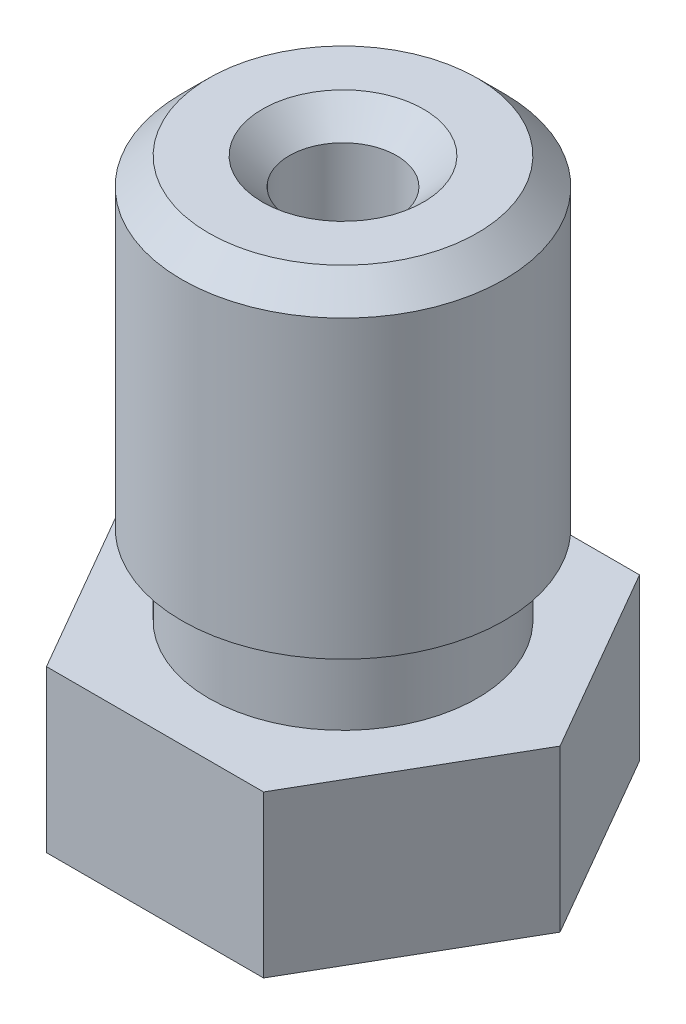
ISO-10303-21;
HEADER;
FILE_DESCRIPTION(('STEP AP214'),'2;1');
FILE_NAME('part.step','',(''),(''),'','','');
FILE_SCHEMA(('AUTOMOTIVE_DESIGN { 1 0 10303 214 1 1 1 1 }'));
ENDSEC;
DATA;
#1=APPLICATION_CONTEXT('core data for automotive mechanical design processes');
#2=APPLICATION_PROTOCOL_DEFINITION('international standard','automotive_design',2000,#1);
#3=PRODUCT_CONTEXT('',#1,'mechanical');
#4=PRODUCT('Part','Part','',(#3));
#5=PRODUCT_RELATED_PRODUCT_CATEGORY('part','',(#4));
#6=PRODUCT_DEFINITION_FORMATION('','',#4);
#7=PRODUCT_DEFINITION_CONTEXT('part definition',#1,'design');
#8=PRODUCT_DEFINITION('design','',#6,#7);
#9=PRODUCT_DEFINITION_SHAPE('','',#8);
#10=(LENGTH_UNIT() NAMED_UNIT(*) SI_UNIT(.MILLI.,.METRE.));
#11=(NAMED_UNIT(*) PLANE_ANGLE_UNIT() SI_UNIT($,.RADIAN.));
#12=(NAMED_UNIT(*) SI_UNIT($,.STERADIAN.) SOLID_ANGLE_UNIT());
#13=UNCERTAINTY_MEASURE_WITH_UNIT(LENGTH_MEASURE(1.E-05),#10,'distance_accuracy_value','');
#14=(GEOMETRIC_REPRESENTATION_CONTEXT(3) GLOBAL_UNCERTAINTY_ASSIGNED_CONTEXT((#13)) GLOBAL_UNIT_ASSIGNED_CONTEXT((#10,
#11,#12)) REPRESENTATION_CONTEXT('',''));
#15=CARTESIAN_POINT('',(0.,0.,0.));
#16=DIRECTION('',(0.,0.,1.));
#17=DIRECTION('',(1.,0.,0.));
#18=AXIS2_PLACEMENT_3D('',#15,#16,#17);
#19=CARTESIAN_POINT('',(2.02072594216369,3.,3.5));
#20=DIRECTION('',(0.,0.,1.));
#21=DIRECTION('',(1.,0.,0.));
#22=AXIS2_PLACEMENT_3D('',#19,#20,#21);
#23=PLANE('',#22);
#24=DIRECTION('',(-1.,0.,0.));
#25=VECTOR('',#24,1.);
#26=CARTESIAN_POINT('',(2.02072594216369,0.,3.5));
#27=LINE('',#26,#25);
#28=CARTESIAN_POINT('',(2.02072594216369,0.,3.5));
#29=VERTEX_POINT('',#28);
#30=CARTESIAN_POINT('',(-2.02072594216369,0.,3.5));
#31=VERTEX_POINT('',#30);
#32=EDGE_CURVE('E121',#29,#31,#27,.T.);
#33=ORIENTED_EDGE('',*,*,#32,.F.);
#34=DIRECTION('',(0.,-1.,0.));
#35=VECTOR('',#34,1.);
#36=CARTESIAN_POINT('',(2.02072594216369,3.,3.5));
#37=LINE('',#36,#35);
#38=CARTESIAN_POINT('',(2.02072594216369,3.,3.5));
#39=VERTEX_POINT('',#38);
#40=EDGE_CURVE('E50',#39,#29,#37,.T.);
#41=ORIENTED_EDGE('',*,*,#40,.F.);
#42=DIRECTION('',(-1.,0.,0.));
#43=VECTOR('',#42,1.);
#44=CARTESIAN_POINT('',(2.02072594216369,3.,3.5));
#45=LINE('',#44,#43);
#46=CARTESIAN_POINT('',(-2.02072594216369,3.,3.5));
#47=VERTEX_POINT('',#46);
#48=EDGE_CURVE('E137',#39,#47,#45,.T.);
#49=ORIENTED_EDGE('',*,*,#48,.T.);
#50=DIRECTION('',(0.,-1.,0.));
#51=VECTOR('',#50,1.);
#52=CARTESIAN_POINT('',(-2.02072594216369,3.,3.5));
#53=LINE('',#52,#51);
#54=EDGE_CURVE('E85',#47,#31,#53,.T.);
#55=ORIENTED_EDGE('',*,*,#54,.T.);
#56=EDGE_LOOP('',(#33,#41,#49,#55));
#57=FACE_BOUND('',#56,.T.);
#58=ADVANCED_FACE('F33',(#57),#23,.T.);
#59=CARTESIAN_POINT('',(4.04145188432738,3.,0.));
#60=DIRECTION('',(0.866025403784439,0.,0.5));
#61=DIRECTION('',(0.5,0.,-0.866025403784439));
#62=AXIS2_PLACEMENT_3D('',#59,#60,#61);
#63=PLANE('',#62);
#64=DIRECTION('',(-0.5,0.,0.866025403784439));
#65=VECTOR('',#64,1.);
#66=CARTESIAN_POINT('',(4.04145188432738,0.,0.));
#67=LINE('',#66,#65);
#68=CARTESIAN_POINT('',(4.04145188432738,0.,0.));
#69=VERTEX_POINT('',#68);
#70=EDGE_CURVE('E134',#69,#29,#67,.T.);
#71=ORIENTED_EDGE('',*,*,#70,.F.);
#72=DIRECTION('',(0.,-1.,0.));
#73=VECTOR('',#72,1.);
#74=CARTESIAN_POINT('',(4.04145188432738,3.,0.));
#75=LINE('',#74,#73);
#76=CARTESIAN_POINT('',(4.04145188432738,3.,0.));
#77=VERTEX_POINT('',#76);
#78=EDGE_CURVE('E73',#77,#69,#75,.T.);
#79=ORIENTED_EDGE('',*,*,#78,.F.);
#80=DIRECTION('',(-0.5,0.,0.866025403784439));
#81=VECTOR('',#80,1.);
#82=CARTESIAN_POINT('',(4.04145188432738,3.,0.));
#83=LINE('',#82,#81);
#84=EDGE_CURVE('E111',#77,#39,#83,.T.);
#85=ORIENTED_EDGE('',*,*,#84,.T.);
#86=ORIENTED_EDGE('',*,*,#40,.T.);
#87=EDGE_LOOP('',(#71,#79,#85,#86));
#88=FACE_BOUND('',#87,.T.);
#89=ADVANCED_FACE('F210',(#88),#63,.T.);
#90=CARTESIAN_POINT('',(2.02072594216369,3.,-3.5));
#91=DIRECTION('',(0.866025403784438,0.,-0.500000000000001));
#92=DIRECTION('',(-0.500000000000001,0.,-0.866025403784438));
#93=AXIS2_PLACEMENT_3D('',#90,#91,#92);
#94=PLANE('',#93);
#95=DIRECTION('',(0.500000000000001,0.,0.866025403784438));
#96=VECTOR('',#95,1.);
#97=CARTESIAN_POINT('',(2.02072594216369,0.,-3.5));
#98=LINE('',#97,#96);
#99=CARTESIAN_POINT('',(2.02072594216369,0.,-3.5));
#100=VERTEX_POINT('',#99);
#101=EDGE_CURVE('E98',#100,#69,#98,.T.);
#102=ORIENTED_EDGE('',*,*,#101,.F.);
#103=DIRECTION('',(0.,-1.,0.));
#104=VECTOR('',#103,1.);
#105=CARTESIAN_POINT('',(2.02072594216369,3.,-3.5));
#106=LINE('',#105,#104);
#107=CARTESIAN_POINT('',(2.02072594216369,3.,-3.5));
#108=VERTEX_POINT('',#107);
#109=EDGE_CURVE('E93',#108,#100,#106,.T.);
#110=ORIENTED_EDGE('',*,*,#109,.F.);
#111=DIRECTION('',(0.500000000000001,0.,0.866025403784438));
#112=VECTOR('',#111,1.);
#113=CARTESIAN_POINT('',(2.02072594216369,3.,-3.5));
#114=LINE('',#113,#112);
#115=EDGE_CURVE('E96',#108,#77,#114,.T.);
#116=ORIENTED_EDGE('',*,*,#115,.T.);
#117=ORIENTED_EDGE('',*,*,#78,.T.);
#118=EDGE_LOOP('',(#102,#110,#116,#117));
#119=FACE_BOUND('',#118,.T.);
#120=ADVANCED_FACE('F95',(#119),#94,.T.);
#121=CARTESIAN_POINT('',(-2.02072594216369,3.,-3.5));
#122=DIRECTION('',(0.,0.,-1.));
#123=DIRECTION('',(-1.,0.,0.));
#124=AXIS2_PLACEMENT_3D('',#121,#122,#123);
#125=PLANE('',#124);
#126=DIRECTION('',(1.,0.,0.));
#127=VECTOR('',#126,1.);
#128=CARTESIAN_POINT('',(-2.02072594216369,0.,-3.5));
#129=LINE('',#128,#127);
#130=CARTESIAN_POINT('',(-2.02072594216369,0.,-3.5));
#131=VERTEX_POINT('',#130);
#132=EDGE_CURVE('E131',#131,#100,#129,.T.);
#133=ORIENTED_EDGE('',*,*,#132,.F.);
#134=DIRECTION('',(0.,-1.,0.));
#135=VECTOR('',#134,1.);
#136=CARTESIAN_POINT('',(-2.02072594216369,3.,-3.5));
#137=LINE('',#136,#135);
#138=CARTESIAN_POINT('',(-2.02072594216369,3.,-3.5));
#139=VERTEX_POINT('',#138);
#140=EDGE_CURVE('E103',#139,#131,#137,.T.);
#141=ORIENTED_EDGE('',*,*,#140,.F.);
#142=DIRECTION('',(1.,0.,0.));
#143=VECTOR('',#142,1.);
#144=CARTESIAN_POINT('',(-2.02072594216369,3.,-3.5));
#145=LINE('',#144,#143);
#146=EDGE_CURVE('E109',#139,#108,#145,.T.);
#147=ORIENTED_EDGE('',*,*,#146,.T.);
#148=ORIENTED_EDGE('',*,*,#109,.T.);
#149=EDGE_LOOP('',(#133,#141,#147,#148));
#150=FACE_BOUND('',#149,.T.);
#151=ADVANCED_FACE('F113',(#150),#125,.T.);
#152=CARTESIAN_POINT('',(-4.04145188432738,3.,0.));
#153=DIRECTION('',(-0.866025403784439,0.,-0.5));
#154=DIRECTION('',(-0.5,0.,0.866025403784439));
#155=AXIS2_PLACEMENT_3D('',#152,#153,#154);
#156=PLANE('',#155);
#157=DIRECTION('',(0.5,0.,-0.866025403784439));
#158=VECTOR('',#157,1.);
#159=CARTESIAN_POINT('',(-4.04145188432738,0.,0.));
#160=LINE('',#159,#158);
#161=CARTESIAN_POINT('',(-4.04145188432738,0.,0.));
#162=VERTEX_POINT('',#161);
#163=EDGE_CURVE('E128',#162,#131,#160,.T.);
#164=ORIENTED_EDGE('',*,*,#163,.F.);
#165=DIRECTION('',(0.,-1.,0.));
#166=VECTOR('',#165,1.);
#167=CARTESIAN_POINT('',(-4.04145188432738,3.,0.));
#168=LINE('',#167,#166);
#169=CARTESIAN_POINT('',(-4.04145188432738,3.,0.));
#170=VERTEX_POINT('',#169);
#171=EDGE_CURVE('E142',#170,#162,#168,.T.);
#172=ORIENTED_EDGE('',*,*,#171,.F.);
#173=DIRECTION('',(0.5,0.,-0.866025403784439));
#174=VECTOR('',#173,1.);
#175=CARTESIAN_POINT('',(-4.04145188432738,3.,0.));
#176=LINE('',#175,#174);
#177=EDGE_CURVE('E114',#170,#139,#176,.T.);
#178=ORIENTED_EDGE('',*,*,#177,.T.);
#179=ORIENTED_EDGE('',*,*,#140,.T.);
#180=EDGE_LOOP('',(#164,#172,#178,#179));
#181=FACE_BOUND('',#180,.T.);
#182=ADVANCED_FACE('F224',(#181),#156,.T.);
#183=CARTESIAN_POINT('',(-2.02072594216369,3.,3.5));
#184=DIRECTION('',(-0.866025403784439,0.,0.5));
#185=DIRECTION('',(0.5,0.,0.866025403784439));
#186=AXIS2_PLACEMENT_3D('',#183,#184,#185);
#187=PLANE('',#186);
#188=DIRECTION('',(-0.5,0.,-0.866025403784439));
#189=VECTOR('',#188,1.);
#190=CARTESIAN_POINT('',(-2.02072594216369,0.,3.5));
#191=LINE('',#190,#189);
#192=EDGE_CURVE('E124',#31,#162,#191,.T.);
#193=ORIENTED_EDGE('',*,*,#192,.F.);
#194=ORIENTED_EDGE('',*,*,#54,.F.);
#195=DIRECTION('',(-0.5,0.,-0.866025403784439));
#196=VECTOR('',#195,1.);
#197=CARTESIAN_POINT('',(-2.02072594216369,3.,3.5));
#198=LINE('',#197,#196);
#199=EDGE_CURVE('E116',#47,#170,#198,.T.);
#200=ORIENTED_EDGE('',*,*,#199,.T.);
#201=ORIENTED_EDGE('',*,*,#171,.T.);
#202=EDGE_LOOP('',(#193,#194,#200,#201));
#203=FACE_BOUND('',#202,.T.);
#204=ADVANCED_FACE('F206',(#203),#187,.T.);
#205=CARTESIAN_POINT('',(0.,3.,0.));
#206=DIRECTION('',(0.,-1.,0.));
#207=DIRECTION('',(0.,0.,-1.));
#208=AXIS2_PLACEMENT_3D('',#205,#206,#207);
#209=PLANE('',#208);
#210=CARTESIAN_POINT('',(0.,3.,0.));
#211=DIRECTION('',(0.,1.,0.));
#212=DIRECTION('',(0.,0.,1.));
#213=AXIS2_PLACEMENT_3D('',#210,#211,#212);
#214=CIRCLE('',#213,2.5);
#215=CARTESIAN_POINT('',(0.,3.,2.5));
#216=VERTEX_POINT('',#215);
#217=EDGE_CURVE('E125',#216,#216,#214,.T.);
#218=ORIENTED_EDGE('',*,*,#217,.F.);
#219=EDGE_LOOP('',(#218));
#220=FACE_BOUND('',#219,.T.);
#221=ORIENTED_EDGE('',*,*,#48,.F.);
#222=ORIENTED_EDGE('',*,*,#84,.F.);
#223=ORIENTED_EDGE('',*,*,#115,.F.);
#224=ORIENTED_EDGE('',*,*,#146,.F.);
#225=ORIENTED_EDGE('',*,*,#177,.F.);
#226=ORIENTED_EDGE('',*,*,#199,.F.);
#227=EDGE_LOOP('',(#221,#222,#223,#224,#225,#226));
#228=FACE_BOUND('',#227,.T.);
#229=ADVANCED_FACE('F107',(#220,#228),#209,.F.);
#230=CARTESIAN_POINT('',(0.,0.,0.));
#231=DIRECTION('',(0.,-1.,0.));
#232=DIRECTION('',(0.,0.,-1.));
#233=AXIS2_PLACEMENT_3D('',#230,#231,#232);
#234=PLANE('',#233);
#235=CARTESIAN_POINT('',(0.,0.,0.));
#236=DIRECTION('',(0.,-1.,0.));
#237=DIRECTION('',(0.,0.,-1.));
#238=AXIS2_PLACEMENT_3D('',#235,#236,#237);
#239=CIRCLE('',#238,2.50000000004502);
#240=CARTESIAN_POINT('',(0.,0.,-2.50000000004502));
#241=VERTEX_POINT('',#240);
#242=EDGE_CURVE('E139',#241,#241,#239,.T.);
#243=ORIENTED_EDGE('',*,*,#242,.F.);
#244=EDGE_LOOP('',(#243));
#245=FACE_BOUND('',#244,.T.);
#246=ORIENTED_EDGE('',*,*,#32,.T.);
#247=ORIENTED_EDGE('',*,*,#192,.T.);
#248=ORIENTED_EDGE('',*,*,#163,.T.);
#249=ORIENTED_EDGE('',*,*,#132,.T.);
#250=ORIENTED_EDGE('',*,*,#101,.T.);
#251=ORIENTED_EDGE('',*,*,#70,.T.);
#252=EDGE_LOOP('',(#246,#247,#248,#249,#250,#251));
#253=FACE_BOUND('',#252,.T.);
#254=ADVANCED_FACE('F209',(#245,#253),#234,.T.);
#255=CARTESIAN_POINT('',(0.,3.,0.));
#256=DIRECTION('',(0.,1.,0.));
#257=DIRECTION('',(0.,0.,1.));
#258=AXIS2_PLACEMENT_3D('',#255,#256,#257);
#259=CYLINDRICAL_SURFACE('',#258,2.5);
#260=ORIENTED_EDGE('',*,*,#217,.T.);
#261=EDGE_LOOP('',(#260));
#262=FACE_BOUND('',#261,.T.);
#263=CARTESIAN_POINT('',(0.,4.5,0.));
#264=DIRECTION('',(0.,1.,0.));
#265=DIRECTION('',(0.,0.,1.));
#266=AXIS2_PLACEMENT_3D('',#263,#264,#265);
#267=CIRCLE('',#266,2.5);
#268=CARTESIAN_POINT('',(0.,4.5,2.5));
#269=VERTEX_POINT('',#268);
#270=EDGE_CURVE('E198',#269,#269,#267,.T.);
#271=ORIENTED_EDGE('',*,*,#270,.F.);
#272=EDGE_LOOP('',(#271));
#273=FACE_BOUND('',#272,.T.);
#274=ADVANCED_FACE('F167',(#262,#273),#259,.T.);
#275=CARTESIAN_POINT('',(0.,10.5,0.));
#276=DIRECTION('',(0.,1.,0.));
#277=DIRECTION('',(0.,0.,1.));
#278=AXIS2_PLACEMENT_3D('',#275,#276,#277);
#279=PLANE('',#278);
#280=CARTESIAN_POINT('',(0.,10.5,0.));
#281=DIRECTION('',(0.,1.,0.));
#282=DIRECTION('',(0.,0.,1.));
#283=AXIS2_PLACEMENT_3D('',#280,#281,#282);
#284=CIRCLE('',#283,2.4999999999834);
#285=CARTESIAN_POINT('',(0.,10.5,2.4999999999834));
#286=VERTEX_POINT('',#285);
#287=EDGE_CURVE('E150',#286,#286,#284,.T.);
#288=ORIENTED_EDGE('',*,*,#287,.T.);
#289=EDGE_LOOP('',(#288));
#290=FACE_BOUND('',#289,.T.);
#291=CARTESIAN_POINT('',(-1.10963134903613E-11,10.5,0.));
#292=DIRECTION('',(0.,1.,0.));
#293=DIRECTION('',(0.,0.,1.));
#294=AXIS2_PLACEMENT_3D('',#291,#292,#293);
#295=CIRCLE('',#294,1.5000000000277);
#296=CARTESIAN_POINT('',(-1.10963134903613E-11,10.5,1.5000000000277));
#297=VERTEX_POINT('',#296);
#298=EDGE_CURVE('E147',#297,#297,#295,.F.);
#299=ORIENTED_EDGE('',*,*,#298,.T.);
#300=EDGE_LOOP('',(#299));
#301=FACE_BOUND('',#300,.T.);
#302=ADVANCED_FACE('F164',(#290,#301),#279,.T.);
#303=CARTESIAN_POINT('',(0.,3.,0.));
#304=DIRECTION('',(0.,1.,0.));
#305=DIRECTION('',(0.,0.,1.));
#306=AXIS2_PLACEMENT_3D('',#303,#304,#305);
#307=CYLINDRICAL_SURFACE('',#306,3.);
#308=CARTESIAN_POINT('',(0.,9.9999999999834,0.));
#309=DIRECTION('',(0.,1.,0.));
#310=DIRECTION('',(0.,0.,1.));
#311=AXIS2_PLACEMENT_3D('',#308,#309,#310);
#312=CIRCLE('',#311,3.);
#313=CARTESIAN_POINT('',(0.,9.9999999999834,3.));
#314=VERTEX_POINT('',#313);
#315=EDGE_CURVE('E42',#314,#314,#312,.F.);
#316=ORIENTED_EDGE('',*,*,#315,.T.);
#317=EDGE_LOOP('',(#316));
#318=FACE_BOUND('',#317,.T.);
#319=CARTESIAN_POINT('',(0.,4.5,0.));
#320=DIRECTION('',(0.,1.,0.));
#321=DIRECTION('',(0.,0.,1.));
#322=AXIS2_PLACEMENT_3D('',#319,#320,#321);
#323=CIRCLE('',#322,3.);
#324=CARTESIAN_POINT('',(0.,4.5,3.));
#325=VERTEX_POINT('',#324);
#326=EDGE_CURVE('E201',#325,#325,#323,.T.);
#327=ORIENTED_EDGE('',*,*,#326,.T.);
#328=EDGE_LOOP('',(#327));
#329=FACE_BOUND('',#328,.T.);
#330=ADVANCED_FACE('F155',(#318,#329),#307,.T.);
#331=CARTESIAN_POINT('',(3.,4.5,0.));
#332=DIRECTION('',(0.,-1.,0.));
#333=DIRECTION('',(0.,0.,-1.));
#334=AXIS2_PLACEMENT_3D('',#331,#332,#333);
#335=PLANE('',#334);
#336=ORIENTED_EDGE('',*,*,#270,.T.);
#337=EDGE_LOOP('',(#336));
#338=FACE_BOUND('',#337,.T.);
#339=ORIENTED_EDGE('',*,*,#326,.F.);
#340=EDGE_LOOP('',(#339));
#341=FACE_BOUND('',#340,.T.);
#342=ADVANCED_FACE('F244',(#338,#341),#335,.T.);
#343=CARTESIAN_POINT('',(0.,-2.,0.));
#344=DIRECTION('',(0.,1.,0.));
#345=DIRECTION('',(-1.,0.,0.));
#346=AXIS2_PLACEMENT_3D('',#343,#344,#345);
#347=CONICAL_SURFACE('',#346,0.50000000004502,0.785398163397449);
#348=ORIENTED_EDGE('',*,*,#242,.T.);
#349=EDGE_LOOP('',(#348));
#350=FACE_BOUND('',#349,.T.);
#351=CARTESIAN_POINT('',(0.,-2.,0.));
#352=DIRECTION('',(0.,-1.,0.));
#353=DIRECTION('',(1.,0.,0.));
#354=AXIS2_PLACEMENT_3D('',#351,#352,#353);
#355=CIRCLE('',#354,0.50000000004502);
#356=CARTESIAN_POINT('',(0.50000000004502,-2.,0.));
#357=VERTEX_POINT('',#356);
#358=EDGE_CURVE('E189',#357,#357,#355,.T.);
#359=ORIENTED_EDGE('',*,*,#358,.F.);
#360=EDGE_LOOP('',(#359));
#361=FACE_BOUND('',#360,.T.);
#362=ADVANCED_FACE('F247',(#350,#361),#347,.T.);
#363=CARTESIAN_POINT('',(0.,-2.,0.));
#364=DIRECTION('',(0.,-1.,0.));
#365=DIRECTION('',(1.,0.,0.));
#366=AXIS2_PLACEMENT_3D('',#363,#364,#365);
#367=PLANE('',#366);
#368=CARTESIAN_POINT('',(-1.10963134903613E-11,-2.,0.));
#369=DIRECTION('',(0.,1.,0.));
#370=DIRECTION('',(0.,0.,1.));
#371=AXIS2_PLACEMENT_3D('',#368,#369,#370);
#372=CIRCLE('',#371,0.25);
#373=CARTESIAN_POINT('',(-1.10963134903613E-11,-2.,0.25));
#374=VERTEX_POINT('',#373);
#375=EDGE_CURVE('E185',#374,#374,#372,.T.);
#376=ORIENTED_EDGE('',*,*,#375,.T.);
#377=EDGE_LOOP('',(#376));
#378=FACE_BOUND('',#377,.T.);
#379=ORIENTED_EDGE('',*,*,#358,.T.);
#380=EDGE_LOOP('',(#379));
#381=FACE_BOUND('',#380,.T.);
#382=ADVANCED_FACE('F251',(#378,#381),#367,.T.);
#383=CARTESIAN_POINT('',(-1.10963134903613E-11,-2.,0.));
#384=DIRECTION('',(0.,1.,0.));
#385=DIRECTION('',(0.,0.,1.));
#386=AXIS2_PLACEMENT_3D('',#383,#384,#385);
#387=CYLINDRICAL_SURFACE('',#386,0.25);
#388=ORIENTED_EDGE('',*,*,#375,.F.);
#389=EDGE_LOOP('',(#388));
#390=FACE_BOUND('',#389,.T.);
#391=CARTESIAN_POINT('',(-1.10963134903613E-11,-1.20000000003984,0.));
#392=DIRECTION('',(0.,1.,0.));
#393=DIRECTION('',(0.,0.,1.));
#394=AXIS2_PLACEMENT_3D('',#391,#392,#393);
#395=CIRCLE('',#394,0.25);
#396=CARTESIAN_POINT('',(-1.10963134903613E-11,-1.20000000003984,0.25));
#397=VERTEX_POINT('',#396);
#398=EDGE_CURVE('E273',#397,#397,#395,.T.);
#399=ORIENTED_EDGE('',*,*,#398,.T.);
#400=EDGE_LOOP('',(#399));
#401=FACE_BOUND('',#400,.T.);
#402=ADVANCED_FACE('F179',(#390,#401),#387,.F.);
#403=CARTESIAN_POINT('',(-1.10963134903613E-11,-2.,0.));
#404=DIRECTION('',(0.,1.,0.));
#405=DIRECTION('',(0.,0.,1.));
#406=AXIS2_PLACEMENT_3D('',#403,#404,#405);
#407=CYLINDRICAL_SURFACE('',#406,1.0000000000111);
#408=CARTESIAN_POINT('',(-1.10963134903613E-11,9.9999999999834,0.));
#409=DIRECTION('',(0.,1.,0.));
#410=DIRECTION('',(0.,0.,1.));
#411=AXIS2_PLACEMENT_3D('',#408,#409,#410);
#412=CIRCLE('',#411,1.0000000000111);
#413=CARTESIAN_POINT('',(-1.10963134903613E-11,9.9999999999834,1.0000000000111));
#414=VERTEX_POINT('',#413);
#415=EDGE_CURVE('E11',#414,#414,#412,.T.);
#416=ORIENTED_EDGE('',*,*,#415,.T.);
#417=EDGE_LOOP('',(#416));
#418=FACE_BOUND('',#417,.T.);
#419=CARTESIAN_POINT('',(-1.10963134903613E-11,0.,0.));
#420=DIRECTION('',(0.,1.,0.));
#421=DIRECTION('',(0.,0.,1.));
#422=AXIS2_PLACEMENT_3D('',#419,#420,#421);
#423=CIRCLE('',#422,1.0000000000111);
#424=CARTESIAN_POINT('',(-1.10963134903613E-11,0.,1.0000000000111));
#425=VERTEX_POINT('',#424);
#426=EDGE_CURVE('E183',#425,#425,#423,.T.);
#427=ORIENTED_EDGE('',*,*,#426,.F.);
#428=EDGE_LOOP('',(#427));
#429=FACE_BOUND('',#428,.T.);
#430=ADVANCED_FACE('F175',(#418,#429),#407,.F.);
#431=CARTESIAN_POINT('',(-1.10963134903613E-11,0.,0.));
#432=DIRECTION('',(0.,1.,0.));
#433=DIRECTION('',(0.,0.,1.));
#434=AXIS2_PLACEMENT_3D('',#431,#432,#433);
#435=CONICAL_SURFACE('',#434,1.0000000000111,0.832981266710198);
#436=CARTESIAN_POINT('',(-1.10963134903613E-11,-0.227272727272521,0.));
#437=DIRECTION('',(0.,1.,0.));
#438=DIRECTION('',(0.,0.,1.));
#439=AXIS2_PLACEMENT_3D('',#436,#437,#438);
#440=CIRCLE('',#439,0.749999999993361);
#441=CARTESIAN_POINT('',(-1.10963134903613E-11,-0.227272727272521,0.749999999993361));
#442=VERTEX_POINT('',#441);
#443=EDGE_CURVE('E186',#442,#442,#440,.T.);
#444=ORIENTED_EDGE('',*,*,#443,.F.);
#445=EDGE_LOOP('',(#444));
#446=FACE_BOUND('',#445,.T.);
#447=ORIENTED_EDGE('',*,*,#426,.T.);
#448=EDGE_LOOP('',(#447));
#449=FACE_BOUND('',#448,.T.);
#450=ADVANCED_FACE('F178',(#446,#449),#435,.F.);
#451=CARTESIAN_POINT('',(-1.10963134903613E-11,-2.,0.));
#452=DIRECTION('',(0.,1.,0.));
#453=DIRECTION('',(0.,0.,1.));
#454=AXIS2_PLACEMENT_3D('',#451,#452,#453);
#455=CYLINDRICAL_SURFACE('',#454,0.749999999993361);
#456=CARTESIAN_POINT('',(-1.10963134903613E-11,-0.700000000000002,0.));
#457=DIRECTION('',(0.,1.,0.));
#458=DIRECTION('',(0.,0.,1.));
#459=AXIS2_PLACEMENT_3D('',#456,#457,#458);
#460=CIRCLE('',#459,0.749999999993361);
#461=CARTESIAN_POINT('',(-1.10963134903613E-11,-0.700000000000002,0.749999999993361));
#462=VERTEX_POINT('',#461);
#463=EDGE_CURVE('E192',#462,#462,#460,.T.);
#464=ORIENTED_EDGE('',*,*,#463,.F.);
#465=EDGE_LOOP('',(#464));
#466=FACE_BOUND('',#465,.T.);
#467=ORIENTED_EDGE('',*,*,#443,.T.);
#468=EDGE_LOOP('',(#467));
#469=FACE_BOUND('',#468,.T.);
#470=ADVANCED_FACE('F261',(#466,#469),#455,.F.);
#471=CARTESIAN_POINT('',(-1.10963134903613E-11,-0.700000000000002,0.));
#472=DIRECTION('',(0.,1.,0.));
#473=DIRECTION('',(0.,0.,1.));
#474=AXIS2_PLACEMENT_3D('',#471,#472,#473);
#475=CONICAL_SURFACE('',#474,0.749999999993361,0.785398163350975);
#476=ORIENTED_EDGE('',*,*,#398,.F.);
#477=EDGE_LOOP('',(#476));
#478=FACE_BOUND('',#477,.T.);
#479=ORIENTED_EDGE('',*,*,#463,.T.);
#480=EDGE_LOOP('',(#479));
#481=FACE_BOUND('',#480,.T.);
#482=ADVANCED_FACE('F161',(#478,#481),#475,.F.);
#483=CARTESIAN_POINT('',(0.,10.5,0.));
#484=DIRECTION('',(0.,-1.,0.));
#485=DIRECTION('',(0.,0.,-1.));
#486=AXIS2_PLACEMENT_3D('',#483,#484,#485);
#487=CONICAL_SURFACE('',#486,2.4999999999834,0.785398163397446);
#488=ORIENTED_EDGE('',*,*,#315,.F.);
#489=EDGE_LOOP('',(#488));
#490=FACE_BOUND('',#489,.T.);
#491=ORIENTED_EDGE('',*,*,#287,.F.);
#492=EDGE_LOOP('',(#491));
#493=FACE_BOUND('',#492,.T.);
#494=ADVANCED_FACE('F158',(#490,#493),#487,.T.);
#495=CARTESIAN_POINT('',(-1.10963134903613E-11,9.9999999999834,0.));
#496=DIRECTION('',(0.,1.,0.));
#497=DIRECTION('',(0.,0.,1.));
#498=AXIS2_PLACEMENT_3D('',#495,#496,#497);
#499=CONICAL_SURFACE('',#498,1.0000000000111,0.785398163397452);
#500=ORIENTED_EDGE('',*,*,#298,.F.);
#501=EDGE_LOOP('',(#500));
#502=FACE_BOUND('',#501,.T.);
#503=ORIENTED_EDGE('',*,*,#415,.F.);
#504=EDGE_LOOP('',(#503));
#505=FACE_BOUND('',#504,.T.);
#506=ADVANCED_FACE('F35',(#502,#505),#499,.F.);
#507=CLOSED_SHELL('',(#58,#89,#120,#151,#182,#204,#229,#254,#274,#302,#330,#342,#362,#382,#402,
#430,#450,#470,#482,#494,#506));
#508=MANIFOLD_SOLID_BREP('B2',#507);
#509=ADVANCED_BREP_SHAPE_REPRESENTATION('',(#18,#508),#14);
#510=SHAPE_DEFINITION_REPRESENTATION(#9,#509);
ENDSEC;
END-ISO-10303-21;
